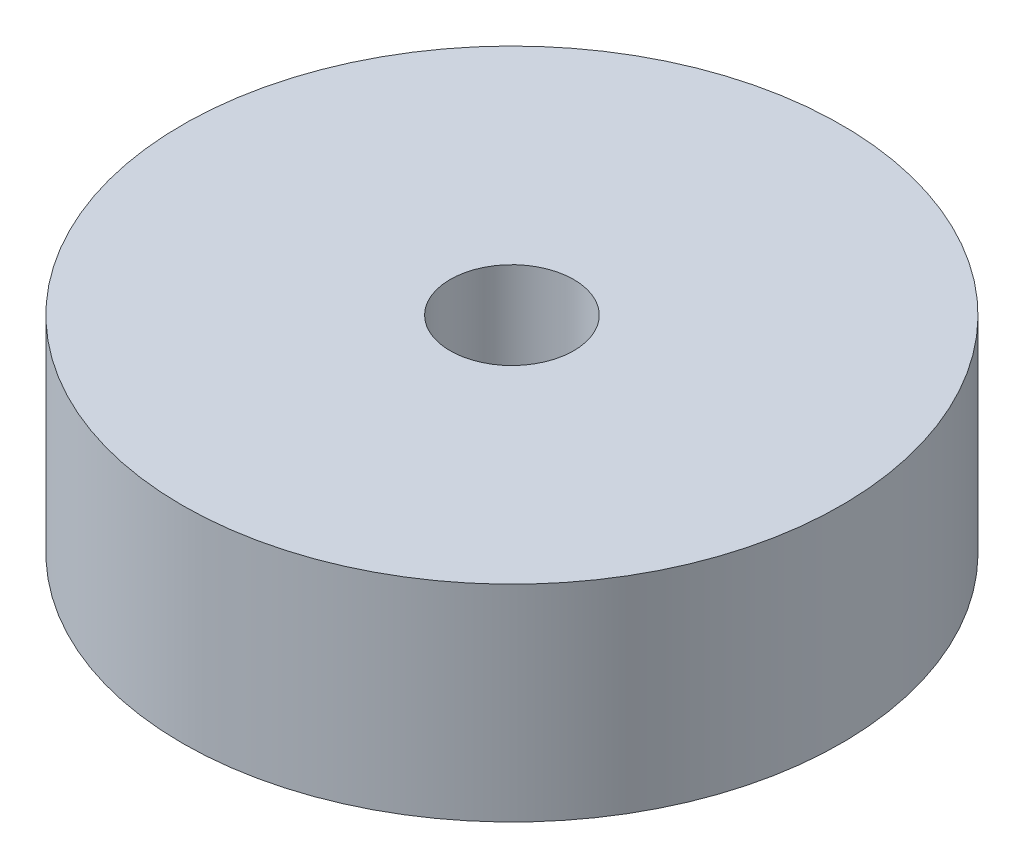
ISO-10303-21;
HEADER;
FILE_DESCRIPTION(('STEP AP214'),'2;1');
FILE_NAME('part.step','',(''),(''),'','','');
FILE_SCHEMA(('AUTOMOTIVE_DESIGN { 1 0 10303 214 1 1 1 1 }'));
ENDSEC;
DATA;
#1=APPLICATION_CONTEXT('core data for automotive mechanical design processes');
#2=APPLICATION_PROTOCOL_DEFINITION('international standard','automotive_design',2000,#1);
#3=PRODUCT_CONTEXT('',#1,'mechanical');
#4=PRODUCT('Part','Part','',(#3));
#5=PRODUCT_RELATED_PRODUCT_CATEGORY('part','',(#4));
#6=PRODUCT_DEFINITION_FORMATION('','',#4);
#7=PRODUCT_DEFINITION_CONTEXT('part definition',#1,'design');
#8=PRODUCT_DEFINITION('design','',#6,#7);
#9=PRODUCT_DEFINITION_SHAPE('','',#8);
#10=(LENGTH_UNIT() NAMED_UNIT(*) SI_UNIT(.MILLI.,.METRE.));
#11=(NAMED_UNIT(*) PLANE_ANGLE_UNIT() SI_UNIT($,.RADIAN.));
#12=(NAMED_UNIT(*) SI_UNIT($,.STERADIAN.) SOLID_ANGLE_UNIT());
#13=UNCERTAINTY_MEASURE_WITH_UNIT(LENGTH_MEASURE(1.E-05),#10,'distance_accuracy_value','');
#14=(GEOMETRIC_REPRESENTATION_CONTEXT(3) GLOBAL_UNCERTAINTY_ASSIGNED_CONTEXT((#13)) GLOBAL_UNIT_ASSIGNED_CONTEXT((#10,
#11,#12)) REPRESENTATION_CONTEXT('',''));
#15=CARTESIAN_POINT('',(0.,0.,0.));
#16=DIRECTION('',(0.,0.,1.));
#17=DIRECTION('',(1.,0.,0.));
#18=AXIS2_PLACEMENT_3D('',#15,#16,#17);
#19=CARTESIAN_POINT('',(1.27,25.4,0.));
#20=DIRECTION('',(0.,-1.,0.));
#21=DIRECTION('',(0.,0.,-1.));
#22=AXIS2_PLACEMENT_3D('',#19,#20,#21);
#23=PLANE('',#22);
#24=CARTESIAN_POINT('',(0.,25.4,0.));
#25=DIRECTION('',(0.,-1.,0.));
#26=DIRECTION('',(0.,0.,-1.));
#27=AXIS2_PLACEMENT_3D('',#24,#25,#26);
#28=CIRCLE('',#27,4.7625);
#29=CARTESIAN_POINT('',(0.,25.4,-4.7625));
#30=VERTEX_POINT('',#29);
#31=EDGE_CURVE('E63',#30,#30,#28,.T.);
#32=ORIENTED_EDGE('',*,*,#31,.T.);
#33=EDGE_LOOP('',(#32));
#34=FACE_BOUND('',#33,.T.);
#35=CARTESIAN_POINT('',(0.,25.4,0.));
#36=DIRECTION('',(0.,1.,0.));
#37=DIRECTION('',(0.,0.,1.));
#38=AXIS2_PLACEMENT_3D('',#35,#36,#37);
#39=CIRCLE('',#38,25.4);
#40=CARTESIAN_POINT('',(0.,25.4,25.4));
#41=VERTEX_POINT('',#40);
#42=EDGE_CURVE('E10',#41,#41,#39,.T.);
#43=ORIENTED_EDGE('',*,*,#42,.T.);
#44=EDGE_LOOP('',(#43));
#45=FACE_BOUND('',#44,.T.);
#46=ADVANCED_FACE('F40',(#34,#45),#23,.F.);
#47=CARTESIAN_POINT('',(0.,41.3060290286454,0.));
#48=DIRECTION('',(0.,1.,0.));
#49=DIRECTION('',(0.,0.,1.));
#50=AXIS2_PLACEMENT_3D('',#47,#48,#49);
#51=CYLINDRICAL_SURFACE('',#50,25.4);
#52=ORIENTED_EDGE('',*,*,#42,.F.);
#53=EDGE_LOOP('',(#52));
#54=FACE_BOUND('',#53,.T.);
#55=CARTESIAN_POINT('',(0.,9.52500000000001,0.));
#56=DIRECTION('',(0.,1.,0.));
#57=DIRECTION('',(0.,0.,1.));
#58=AXIS2_PLACEMENT_3D('',#55,#56,#57);
#59=CIRCLE('',#58,25.4);
#60=CARTESIAN_POINT('',(0.,9.52500000000001,25.4));
#61=VERTEX_POINT('',#60);
#62=EDGE_CURVE('E47',#61,#61,#59,.T.);
#63=ORIENTED_EDGE('',*,*,#62,.T.);
#64=EDGE_LOOP('',(#63));
#65=FACE_BOUND('',#64,.T.);
#66=ADVANCED_FACE('F89',(#54,#65),#51,.T.);
#67=CARTESIAN_POINT('',(25.4,9.525,0.));
#68=DIRECTION('',(0.,1.,0.));
#69=DIRECTION('',(0.,0.,1.));
#70=AXIS2_PLACEMENT_3D('',#67,#68,#69);
#71=PLANE('',#70);
#72=ORIENTED_EDGE('',*,*,#62,.F.);
#73=EDGE_LOOP('',(#72));
#74=FACE_BOUND('',#73,.T.);
#75=CARTESIAN_POINT('',(0.,9.525,0.));
#76=DIRECTION('',(0.,1.,0.));
#77=DIRECTION('',(0.,0.,1.));
#78=AXIS2_PLACEMENT_3D('',#75,#76,#77);
#79=CIRCLE('',#78,9.525);
#80=CARTESIAN_POINT('',(0.,9.525,9.525));
#81=VERTEX_POINT('',#80);
#82=EDGE_CURVE('E52',#81,#81,#79,.T.);
#83=ORIENTED_EDGE('',*,*,#82,.T.);
#84=EDGE_LOOP('',(#83));
#85=FACE_BOUND('',#84,.T.);
#86=ADVANCED_FACE('F83',(#74,#85),#71,.F.);
#87=CARTESIAN_POINT('',(0.,41.3060290286454,0.));
#88=DIRECTION('',(0.,1.,0.));
#89=DIRECTION('',(0.,0.,1.));
#90=AXIS2_PLACEMENT_3D('',#87,#88,#89);
#91=CYLINDRICAL_SURFACE('',#90,9.525);
#92=ORIENTED_EDGE('',*,*,#82,.F.);
#93=EDGE_LOOP('',(#92));
#94=FACE_BOUND('',#93,.T.);
#95=CARTESIAN_POINT('',(0.,0.,0.));
#96=DIRECTION('',(0.,1.,0.));
#97=DIRECTION('',(0.,0.,1.));
#98=AXIS2_PLACEMENT_3D('',#95,#96,#97);
#99=CIRCLE('',#98,9.52500000000001);
#100=CARTESIAN_POINT('',(0.,0.,9.52500000000001));
#101=VERTEX_POINT('',#100);
#102=EDGE_CURVE('E57',#101,#101,#99,.T.);
#103=ORIENTED_EDGE('',*,*,#102,.T.);
#104=EDGE_LOOP('',(#103));
#105=FACE_BOUND('',#104,.T.);
#106=ADVANCED_FACE('F78',(#94,#105),#91,.T.);
#107=CARTESIAN_POINT('',(9.52500000000001,0.,0.));
#108=DIRECTION('',(0.,1.,0.));
#109=DIRECTION('',(0.,0.,1.));
#110=AXIS2_PLACEMENT_3D('',#107,#108,#109);
#111=PLANE('',#110);
#112=CARTESIAN_POINT('',(0.,0.,0.));
#113=DIRECTION('',(0.,-1.,0.));
#114=DIRECTION('',(0.,0.,-1.));
#115=AXIS2_PLACEMENT_3D('',#112,#113,#114);
#116=CIRCLE('',#115,4.7625);
#117=CARTESIAN_POINT('',(0.,0.,-4.7625));
#118=VERTEX_POINT('',#117);
#119=EDGE_CURVE('E67',#118,#118,#116,.T.);
#120=ORIENTED_EDGE('',*,*,#119,.F.);
#121=EDGE_LOOP('',(#120));
#122=FACE_BOUND('',#121,.T.);
#123=ORIENTED_EDGE('',*,*,#102,.F.);
#124=EDGE_LOOP('',(#123));
#125=FACE_BOUND('',#124,.T.);
#126=ADVANCED_FACE('F75',(#122,#125),#111,.F.);
#127=CARTESIAN_POINT('',(0.,28.702,0.));
#128=DIRECTION('',(0.,-1.,0.));
#129=DIRECTION('',(0.,0.,-1.));
#130=AXIS2_PLACEMENT_3D('',#127,#128,#129);
#131=CYLINDRICAL_SURFACE('',#130,4.7625);
#132=ORIENTED_EDGE('',*,*,#119,.T.);
#133=EDGE_LOOP('',(#132));
#134=FACE_BOUND('',#133,.T.);
#135=ORIENTED_EDGE('',*,*,#31,.F.);
#136=EDGE_LOOP('',(#135));
#137=FACE_BOUND('',#136,.T.);
#138=ADVANCED_FACE('F72',(#134,#137),#131,.F.);
#139=CLOSED_SHELL('',(#46,#66,#86,#106,#126,#138));
#140=MANIFOLD_SOLID_BREP('B2',#139);
#141=ADVANCED_BREP_SHAPE_REPRESENTATION('',(#18,#140),#14);
#142=SHAPE_DEFINITION_REPRESENTATION(#9,#141);
ENDSEC;
END-ISO-10303-21;
